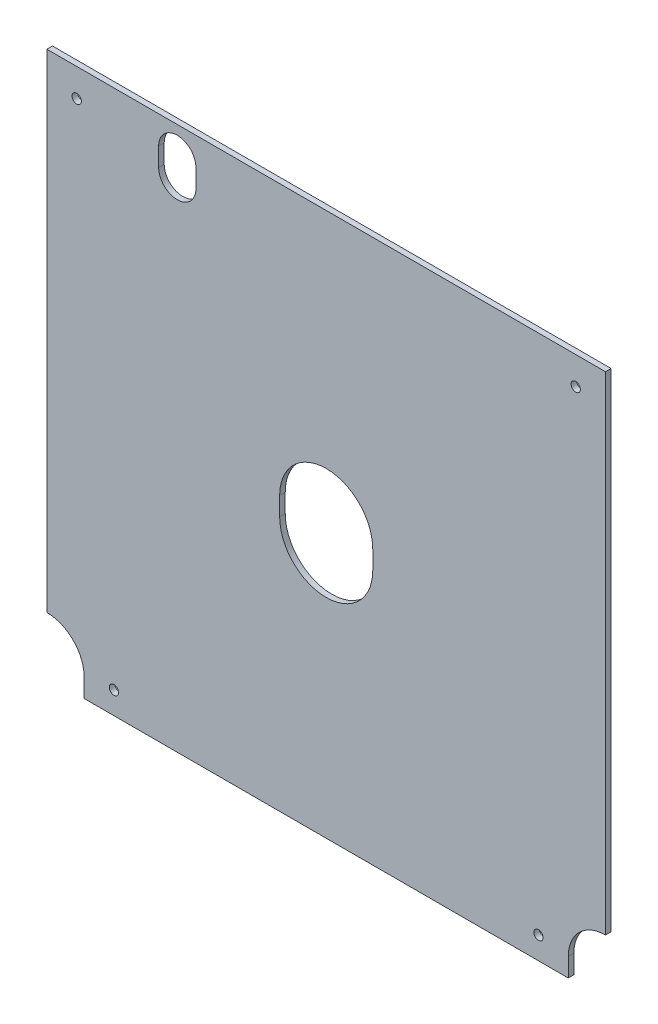
ISO-10303-21;
HEADER;
FILE_DESCRIPTION(('STEP AP214'),'2;1');
FILE_NAME('part.step','',(''),(''),'','','');
FILE_SCHEMA(('AUTOMOTIVE_DESIGN { 1 0 10303 214 1 1 1 1 }'));
ENDSEC;
DATA;
#1=APPLICATION_CONTEXT('core data for automotive mechanical design processes');
#2=APPLICATION_PROTOCOL_DEFINITION('international standard','automotive_design',2000,#1);
#3=PRODUCT_CONTEXT('',#1,'mechanical');
#4=PRODUCT('Part','Part','',(#3));
#5=PRODUCT_RELATED_PRODUCT_CATEGORY('part','',(#4));
#6=PRODUCT_DEFINITION_FORMATION('','',#4);
#7=PRODUCT_DEFINITION_CONTEXT('part definition',#1,'design');
#8=PRODUCT_DEFINITION('design','',#6,#7);
#9=PRODUCT_DEFINITION_SHAPE('','',#8);
#10=(LENGTH_UNIT() NAMED_UNIT(*) SI_UNIT(.MILLI.,.METRE.));
#11=(NAMED_UNIT(*) PLANE_ANGLE_UNIT() SI_UNIT($,.RADIAN.));
#12=(NAMED_UNIT(*) SI_UNIT($,.STERADIAN.) SOLID_ANGLE_UNIT());
#13=UNCERTAINTY_MEASURE_WITH_UNIT(LENGTH_MEASURE(1.E-05),#10,'distance_accuracy_value','');
#14=(GEOMETRIC_REPRESENTATION_CONTEXT(3) GLOBAL_UNCERTAINTY_ASSIGNED_CONTEXT((#13)) GLOBAL_UNIT_ASSIGNED_CONTEXT((#10,
#11,#12)) REPRESENTATION_CONTEXT('',''));
#15=CARTESIAN_POINT('',(0.,0.,0.));
#16=DIRECTION('',(0.,0.,1.));
#17=DIRECTION('',(1.,0.,0.));
#18=AXIS2_PLACEMENT_3D('',#15,#16,#17);
#19=CARTESIAN_POINT('',(-150.,9.99999999999999,3.));
#20=DIRECTION('',(0.,0.,-1.));
#21=DIRECTION('',(-1.,0.,0.));
#22=AXIS2_PLACEMENT_3D('',#19,#20,#21);
#23=PLANE('',#22);
#24=CARTESIAN_POINT('',(114.,12.,3.));
#25=DIRECTION('',(0.,0.,1.));
#26=DIRECTION('',(1.,0.,0.));
#27=AXIS2_PLACEMENT_3D('',#24,#25,#26);
#28=CIRCLE('',#27,2.50000000000001);
#29=CARTESIAN_POINT('',(116.5,12.,3.));
#30=VERTEX_POINT('',#29);
#31=EDGE_CURVE('E400',#30,#30,#28,.T.);
#32=ORIENTED_EDGE('',*,*,#31,.F.);
#33=EDGE_LOOP('',(#32));
#34=FACE_BOUND('',#33,.T.);
#35=CARTESIAN_POINT('',(134.,277.,3.));
#36=DIRECTION('',(0.,0.,1.));
#37=DIRECTION('',(1.,0.,0.));
#38=AXIS2_PLACEMENT_3D('',#35,#36,#37);
#39=CIRCLE('',#38,2.5);
#40=CARTESIAN_POINT('',(136.5,277.,3.));
#41=VERTEX_POINT('',#40);
#42=EDGE_CURVE('E173',#41,#41,#39,.T.);
#43=ORIENTED_EDGE('',*,*,#42,.F.);
#44=EDGE_LOOP('',(#43));
#45=FACE_BOUND('',#44,.T.);
#46=CARTESIAN_POINT('',(0.,137.,3.));
#47=DIRECTION('',(0.,0.,1.));
#48=DIRECTION('',(1.,0.,0.));
#49=AXIS2_PLACEMENT_3D('',#46,#47,#48);
#50=CIRCLE('',#49,25.);
#51=CARTESIAN_POINT('',(-25.,137.,3.));
#52=VERTEX_POINT('',#51);
#53=CARTESIAN_POINT('',(25.,137.,3.));
#54=VERTEX_POINT('',#53);
#55=EDGE_CURVE('E183',#52,#54,#50,.T.);
#56=ORIENTED_EDGE('',*,*,#55,.F.);
#57=DIRECTION('',(0.,-1.,0.));
#58=VECTOR('',#57,1.);
#59=CARTESIAN_POINT('',(-25.,137.,3.));
#60=LINE('',#59,#58);
#61=CARTESIAN_POINT('',(-25.,147.,3.));
#62=VERTEX_POINT('',#61);
#63=EDGE_CURVE('E191',#62,#52,#60,.T.);
#64=ORIENTED_EDGE('',*,*,#63,.F.);
#65=CARTESIAN_POINT('',(0.,147.,3.));
#66=DIRECTION('',(0.,0.,1.));
#67=DIRECTION('',(-1.,0.,0.));
#68=AXIS2_PLACEMENT_3D('',#65,#66,#67);
#69=CIRCLE('',#68,25.);
#70=CARTESIAN_POINT('',(25.,147.,3.));
#71=VERTEX_POINT('',#70);
#72=EDGE_CURVE('E188',#71,#62,#69,.T.);
#73=ORIENTED_EDGE('',*,*,#72,.F.);
#74=DIRECTION('',(0.,1.,0.));
#75=VECTOR('',#74,1.);
#76=CARTESIAN_POINT('',(25.,147.,3.));
#77=LINE('',#76,#75);
#78=EDGE_CURVE('E185',#54,#71,#77,.T.);
#79=ORIENTED_EDGE('',*,*,#78,.F.);
#80=EDGE_LOOP('',(#56,#64,#73,#79));
#81=FACE_BOUND('',#80,.T.);
#82=DIRECTION('',(0.,-1.,0.));
#83=VECTOR('',#82,1.);
#84=CARTESIAN_POINT('',(-150.,292.,3.));
#85=LINE('',#84,#83);
#86=CARTESIAN_POINT('',(-150.,292.,3.));
#87=VERTEX_POINT('',#86);
#88=CARTESIAN_POINT('',(-150.,30.,3.));
#89=VERTEX_POINT('',#88);
#90=EDGE_CURVE('E214',#87,#89,#85,.T.);
#91=ORIENTED_EDGE('',*,*,#90,.T.);
#92=CARTESIAN_POINT('',(-150.,9.99999999999999,3.));
#93=DIRECTION('',(0.,0.,-1.));
#94=DIRECTION('',(-1.,0.,0.));
#95=AXIS2_PLACEMENT_3D('',#92,#93,#94);
#96=CIRCLE('',#95,20.);
#97=CARTESIAN_POINT('',(-130.,9.99999999999999,3.));
#98=VERTEX_POINT('',#97);
#99=EDGE_CURVE('E217',#89,#98,#96,.T.);
#100=ORIENTED_EDGE('',*,*,#99,.T.);
#101=DIRECTION('',(0.,-1.,0.));
#102=VECTOR('',#101,1.);
#103=CARTESIAN_POINT('',(-130.,0.,3.));
#104=LINE('',#103,#102);
#105=CARTESIAN_POINT('',(-130.,0.,3.));
#106=VERTEX_POINT('',#105);
#107=EDGE_CURVE('E220',#98,#106,#104,.T.);
#108=ORIENTED_EDGE('',*,*,#107,.T.);
#109=DIRECTION('',(1.,0.,0.));
#110=VECTOR('',#109,1.);
#111=CARTESIAN_POINT('',(130.,0.,3.));
#112=LINE('',#111,#110);
#113=CARTESIAN_POINT('',(130.,0.,3.));
#114=VERTEX_POINT('',#113);
#115=EDGE_CURVE('E222',#106,#114,#112,.T.);
#116=ORIENTED_EDGE('',*,*,#115,.T.);
#117=DIRECTION('',(0.,1.,0.));
#118=VECTOR('',#117,1.);
#119=CARTESIAN_POINT('',(130.,0.,3.));
#120=LINE('',#119,#118);
#121=CARTESIAN_POINT('',(130.,9.99999999999999,3.));
#122=VERTEX_POINT('',#121);
#123=EDGE_CURVE('E224',#114,#122,#120,.T.);
#124=ORIENTED_EDGE('',*,*,#123,.T.);
#125=CARTESIAN_POINT('',(150.,9.99999999999998,3.));
#126=DIRECTION('',(0.,0.,-1.));
#127=DIRECTION('',(1.,0.,0.));
#128=AXIS2_PLACEMENT_3D('',#125,#126,#127);
#129=CIRCLE('',#128,20.);
#130=CARTESIAN_POINT('',(150.,30.,3.));
#131=VERTEX_POINT('',#130);
#132=EDGE_CURVE('E226',#122,#131,#129,.T.);
#133=ORIENTED_EDGE('',*,*,#132,.T.);
#134=DIRECTION('',(0.,1.,0.));
#135=VECTOR('',#134,1.);
#136=CARTESIAN_POINT('',(150.,292.,3.));
#137=LINE('',#136,#135);
#138=CARTESIAN_POINT('',(150.,292.,3.));
#139=VERTEX_POINT('',#138);
#140=EDGE_CURVE('E228',#131,#139,#137,.T.);
#141=ORIENTED_EDGE('',*,*,#140,.T.);
#142=DIRECTION('',(-1.,0.,0.));
#143=VECTOR('',#142,1.);
#144=CARTESIAN_POINT('',(150.,292.,3.));
#145=LINE('',#144,#143);
#146=EDGE_CURVE('E230',#139,#87,#145,.T.);
#147=ORIENTED_EDGE('',*,*,#146,.T.);
#148=EDGE_LOOP('',(#91,#100,#108,#116,#124,#133,#141,#147));
#149=FACE_BOUND('',#148,.T.);
#150=CARTESIAN_POINT('',(-80.,267.,3.));
#151=DIRECTION('',(0.,0.,1.));
#152=DIRECTION('',(1.,0.,0.));
#153=AXIS2_PLACEMENT_3D('',#150,#151,#152);
#154=CIRCLE('',#153,10.);
#155=CARTESIAN_POINT('',(-90.,267.,3.));
#156=VERTEX_POINT('',#155);
#157=CARTESIAN_POINT('',(-70.,267.,3.));
#158=VERTEX_POINT('',#157);
#159=EDGE_CURVE('E144',#156,#158,#154,.T.);
#160=ORIENTED_EDGE('',*,*,#159,.F.);
#161=DIRECTION('',(0.,-1.,0.));
#162=VECTOR('',#161,1.);
#163=CARTESIAN_POINT('',(-90.,267.,3.));
#164=LINE('',#163,#162);
#165=CARTESIAN_POINT('',(-90.,277.,3.));
#166=VERTEX_POINT('',#165);
#167=EDGE_CURVE('E167',#166,#156,#164,.T.);
#168=ORIENTED_EDGE('',*,*,#167,.F.);
#169=CARTESIAN_POINT('',(-80.,277.,3.));
#170=DIRECTION('',(0.,0.,1.));
#171=DIRECTION('',(-1.,0.,0.));
#172=AXIS2_PLACEMENT_3D('',#169,#170,#171);
#173=CIRCLE('',#172,10.);
#174=CARTESIAN_POINT('',(-70.,277.,3.));
#175=VERTEX_POINT('',#174);
#176=EDGE_CURVE('E165',#175,#166,#173,.T.);
#177=ORIENTED_EDGE('',*,*,#176,.F.);
#178=DIRECTION('',(0.,1.,0.));
#179=VECTOR('',#178,1.);
#180=CARTESIAN_POINT('',(-70.,277.,3.));
#181=LINE('',#180,#179);
#182=EDGE_CURVE('E152',#158,#175,#181,.T.);
#183=ORIENTED_EDGE('',*,*,#182,.F.);
#184=EDGE_LOOP('',(#160,#168,#177,#183));
#185=FACE_BOUND('',#184,.T.);
#186=CARTESIAN_POINT('',(-134.,277.,3.));
#187=DIRECTION('',(0.,0.,1.));
#188=DIRECTION('',(-1.,0.,0.));
#189=AXIS2_PLACEMENT_3D('',#186,#187,#188);
#190=CIRCLE('',#189,2.5);
#191=CARTESIAN_POINT('',(-136.5,277.,3.));
#192=VERTEX_POINT('',#191);
#193=EDGE_CURVE('E406',#192,#192,#190,.T.);
#194=ORIENTED_EDGE('',*,*,#193,.F.);
#195=EDGE_LOOP('',(#194));
#196=FACE_BOUND('',#195,.T.);
#197=CARTESIAN_POINT('',(-114.,12.,3.));
#198=DIRECTION('',(0.,0.,1.));
#199=DIRECTION('',(-1.,0.,0.));
#200=AXIS2_PLACEMENT_3D('',#197,#198,#199);
#201=CIRCLE('',#200,2.50000000000001);
#202=CARTESIAN_POINT('',(-116.5,12.,3.));
#203=VERTEX_POINT('',#202);
#204=EDGE_CURVE('E391',#203,#203,#201,.T.);
#205=ORIENTED_EDGE('',*,*,#204,.F.);
#206=EDGE_LOOP('',(#205));
#207=FACE_BOUND('',#206,.T.);
#208=ADVANCED_FACE('F31',(#34,#45,#81,#149,#185,#196,#207),#23,.F.);
#209=CARTESIAN_POINT('',(-150.,9.99999999999999,0.));
#210=DIRECTION('',(0.,0.,-1.));
#211=DIRECTION('',(-1.,0.,0.));
#212=AXIS2_PLACEMENT_3D('',#209,#210,#211);
#213=PLANE('',#212);
#214=CARTESIAN_POINT('',(114.,12.,0.));
#215=DIRECTION('',(0.,0.,1.));
#216=DIRECTION('',(1.,0.,0.));
#217=AXIS2_PLACEMENT_3D('',#214,#215,#216);
#218=CIRCLE('',#217,2.50000000000001);
#219=CARTESIAN_POINT('',(116.5,12.,0.));
#220=VERTEX_POINT('',#219);
#221=EDGE_CURVE('E397',#220,#220,#218,.T.);
#222=ORIENTED_EDGE('',*,*,#221,.T.);
#223=EDGE_LOOP('',(#222));
#224=FACE_BOUND('',#223,.T.);
#225=CARTESIAN_POINT('',(134.,277.,0.));
#226=DIRECTION('',(0.,0.,1.));
#227=DIRECTION('',(1.,0.,0.));
#228=AXIS2_PLACEMENT_3D('',#225,#226,#227);
#229=CIRCLE('',#228,2.5);
#230=CARTESIAN_POINT('',(136.5,277.,0.));
#231=VERTEX_POINT('',#230);
#232=EDGE_CURVE('E409',#231,#231,#229,.T.);
#233=ORIENTED_EDGE('',*,*,#232,.T.);
#234=EDGE_LOOP('',(#233));
#235=FACE_BOUND('',#234,.T.);
#236=DIRECTION('',(0.,-1.,0.));
#237=VECTOR('',#236,1.);
#238=CARTESIAN_POINT('',(-25.,137.,0.));
#239=LINE('',#238,#237);
#240=CARTESIAN_POINT('',(-25.,147.,0.));
#241=VERTEX_POINT('',#240);
#242=CARTESIAN_POINT('',(-25.,137.,0.));
#243=VERTEX_POINT('',#242);
#244=EDGE_CURVE('E186',#241,#243,#239,.T.);
#245=ORIENTED_EDGE('',*,*,#244,.T.);
#246=CARTESIAN_POINT('',(0.,137.,0.));
#247=DIRECTION('',(0.,0.,1.));
#248=DIRECTION('',(1.,0.,0.));
#249=AXIS2_PLACEMENT_3D('',#246,#247,#248);
#250=CIRCLE('',#249,25.);
#251=CARTESIAN_POINT('',(25.,137.,0.));
#252=VERTEX_POINT('',#251);
#253=EDGE_CURVE('E160',#243,#252,#250,.T.);
#254=ORIENTED_EDGE('',*,*,#253,.T.);
#255=DIRECTION('',(0.,1.,0.));
#256=VECTOR('',#255,1.);
#257=CARTESIAN_POINT('',(25.,147.,0.));
#258=LINE('',#257,#256);
#259=CARTESIAN_POINT('',(25.,147.,0.));
#260=VERTEX_POINT('',#259);
#261=EDGE_CURVE('E196',#252,#260,#258,.T.);
#262=ORIENTED_EDGE('',*,*,#261,.T.);
#263=CARTESIAN_POINT('',(0.,147.,0.));
#264=DIRECTION('',(0.,0.,1.));
#265=DIRECTION('',(-1.,0.,0.));
#266=AXIS2_PLACEMENT_3D('',#263,#264,#265);
#267=CIRCLE('',#266,25.);
#268=EDGE_CURVE('E199',#260,#241,#267,.T.);
#269=ORIENTED_EDGE('',*,*,#268,.T.);
#270=EDGE_LOOP('',(#245,#254,#262,#269));
#271=FACE_BOUND('',#270,.T.);
#272=DIRECTION('',(0.,-1.,0.));
#273=VECTOR('',#272,1.);
#274=CARTESIAN_POINT('',(-150.,292.,0.));
#275=LINE('',#274,#273);
#276=CARTESIAN_POINT('',(-150.,292.,0.));
#277=VERTEX_POINT('',#276);
#278=CARTESIAN_POINT('',(-150.,30.,0.));
#279=VERTEX_POINT('',#278);
#280=EDGE_CURVE('E213',#277,#279,#275,.T.);
#281=ORIENTED_EDGE('',*,*,#280,.F.);
#282=DIRECTION('',(-1.,0.,0.));
#283=VECTOR('',#282,1.);
#284=CARTESIAN_POINT('',(150.,292.,0.));
#285=LINE('',#284,#283);
#286=CARTESIAN_POINT('',(150.,292.,0.));
#287=VERTEX_POINT('',#286);
#288=EDGE_CURVE('E218',#287,#277,#285,.T.);
#289=ORIENTED_EDGE('',*,*,#288,.F.);
#290=DIRECTION('',(0.,1.,0.));
#291=VECTOR('',#290,1.);
#292=CARTESIAN_POINT('',(150.,292.,0.));
#293=LINE('',#292,#291);
#294=CARTESIAN_POINT('',(150.,30.,0.));
#295=VERTEX_POINT('',#294);
#296=EDGE_CURVE('E245',#295,#287,#293,.T.);
#297=ORIENTED_EDGE('',*,*,#296,.F.);
#298=CARTESIAN_POINT('',(150.,9.99999999999998,0.));
#299=DIRECTION('',(0.,0.,-1.));
#300=DIRECTION('',(1.,0.,0.));
#301=AXIS2_PLACEMENT_3D('',#298,#299,#300);
#302=CIRCLE('',#301,20.);
#303=CARTESIAN_POINT('',(130.,9.99999999999999,0.));
#304=VERTEX_POINT('',#303);
#305=EDGE_CURVE('E243',#304,#295,#302,.T.);
#306=ORIENTED_EDGE('',*,*,#305,.F.);
#307=DIRECTION('',(0.,1.,0.));
#308=VECTOR('',#307,1.);
#309=CARTESIAN_POINT('',(130.,0.,0.));
#310=LINE('',#309,#308);
#311=CARTESIAN_POINT('',(130.,0.,0.));
#312=VERTEX_POINT('',#311);
#313=EDGE_CURVE('E241',#312,#304,#310,.T.);
#314=ORIENTED_EDGE('',*,*,#313,.F.);
#315=DIRECTION('',(1.,0.,0.));
#316=VECTOR('',#315,1.);
#317=CARTESIAN_POINT('',(130.,0.,0.));
#318=LINE('',#317,#316);
#319=CARTESIAN_POINT('',(-130.,0.,0.));
#320=VERTEX_POINT('',#319);
#321=EDGE_CURVE('E239',#320,#312,#318,.T.);
#322=ORIENTED_EDGE('',*,*,#321,.F.);
#323=DIRECTION('',(0.,-1.,0.));
#324=VECTOR('',#323,1.);
#325=CARTESIAN_POINT('',(-130.,0.,0.));
#326=LINE('',#325,#324);
#327=CARTESIAN_POINT('',(-130.,9.99999999999999,0.));
#328=VERTEX_POINT('',#327);
#329=EDGE_CURVE('E237',#328,#320,#326,.T.);
#330=ORIENTED_EDGE('',*,*,#329,.F.);
#331=CARTESIAN_POINT('',(-150.,9.99999999999999,0.));
#332=DIRECTION('',(0.,0.,-1.));
#333=DIRECTION('',(-1.,0.,0.));
#334=AXIS2_PLACEMENT_3D('',#331,#332,#333);
#335=CIRCLE('',#334,20.);
#336=EDGE_CURVE('E235',#279,#328,#335,.T.);
#337=ORIENTED_EDGE('',*,*,#336,.F.);
#338=EDGE_LOOP('',(#281,#289,#297,#306,#314,#322,#330,#337));
#339=FACE_BOUND('',#338,.T.);
#340=DIRECTION('',(0.,-1.,0.));
#341=VECTOR('',#340,1.);
#342=CARTESIAN_POINT('',(-90.,267.,0.));
#343=LINE('',#342,#341);
#344=CARTESIAN_POINT('',(-90.,277.,0.));
#345=VERTEX_POINT('',#344);
#346=CARTESIAN_POINT('',(-90.,267.,0.));
#347=VERTEX_POINT('',#346);
#348=EDGE_CURVE('E153',#345,#347,#343,.T.);
#349=ORIENTED_EDGE('',*,*,#348,.T.);
#350=CARTESIAN_POINT('',(-80.,267.,0.));
#351=DIRECTION('',(0.,0.,1.));
#352=DIRECTION('',(1.,0.,0.));
#353=AXIS2_PLACEMENT_3D('',#350,#351,#352);
#354=CIRCLE('',#353,10.);
#355=CARTESIAN_POINT('',(-70.,267.,0.));
#356=VERTEX_POINT('',#355);
#357=EDGE_CURVE('E54',#347,#356,#354,.T.);
#358=ORIENTED_EDGE('',*,*,#357,.T.);
#359=DIRECTION('',(0.,1.,0.));
#360=VECTOR('',#359,1.);
#361=CARTESIAN_POINT('',(-70.,277.,0.));
#362=LINE('',#361,#360);
#363=CARTESIAN_POINT('',(-70.,277.,0.));
#364=VERTEX_POINT('',#363);
#365=EDGE_CURVE('E159',#356,#364,#362,.T.);
#366=ORIENTED_EDGE('',*,*,#365,.T.);
#367=CARTESIAN_POINT('',(-80.,277.,0.));
#368=DIRECTION('',(0.,0.,1.));
#369=DIRECTION('',(-1.,0.,0.));
#370=AXIS2_PLACEMENT_3D('',#367,#368,#369);
#371=CIRCLE('',#370,10.);
#372=EDGE_CURVE('E175',#364,#345,#371,.T.);
#373=ORIENTED_EDGE('',*,*,#372,.T.);
#374=EDGE_LOOP('',(#349,#358,#366,#373));
#375=FACE_BOUND('',#374,.T.);
#376=CARTESIAN_POINT('',(-134.,277.,0.));
#377=DIRECTION('',(0.,0.,1.));
#378=DIRECTION('',(-1.,0.,0.));
#379=AXIS2_PLACEMENT_3D('',#376,#377,#378);
#380=CIRCLE('',#379,2.5);
#381=CARTESIAN_POINT('',(-136.5,277.,0.));
#382=VERTEX_POINT('',#381);
#383=EDGE_CURVE('E403',#382,#382,#380,.T.);
#384=ORIENTED_EDGE('',*,*,#383,.T.);
#385=EDGE_LOOP('',(#384));
#386=FACE_BOUND('',#385,.T.);
#387=CARTESIAN_POINT('',(-114.,12.,0.));
#388=DIRECTION('',(0.,0.,1.));
#389=DIRECTION('',(-1.,0.,0.));
#390=AXIS2_PLACEMENT_3D('',#387,#388,#389);
#391=CIRCLE('',#390,2.50000000000001);
#392=CARTESIAN_POINT('',(-116.5,12.,0.));
#393=VERTEX_POINT('',#392);
#394=EDGE_CURVE('E394',#393,#393,#391,.T.);
#395=ORIENTED_EDGE('',*,*,#394,.T.);
#396=EDGE_LOOP('',(#395));
#397=FACE_BOUND('',#396,.T.);
#398=ADVANCED_FACE('F275',(#224,#235,#271,#339,#375,#386,#397),#213,.T.);
#399=CARTESIAN_POINT('',(-150.,292.,3.));
#400=DIRECTION('',(1.,0.,0.));
#401=DIRECTION('',(0.,1.,0.));
#402=AXIS2_PLACEMENT_3D('',#399,#400,#401);
#403=PLANE('',#402);
#404=ORIENTED_EDGE('',*,*,#280,.T.);
#405=DIRECTION('',(0.,0.,-1.));
#406=VECTOR('',#405,1.);
#407=CARTESIAN_POINT('',(-150.,30.,3.));
#408=LINE('',#407,#406);
#409=EDGE_CURVE('E11',#89,#279,#408,.T.);
#410=ORIENTED_EDGE('',*,*,#409,.F.);
#411=ORIENTED_EDGE('',*,*,#90,.F.);
#412=DIRECTION('',(0.,0.,-1.));
#413=VECTOR('',#412,1.);
#414=CARTESIAN_POINT('',(-150.,292.,3.));
#415=LINE('',#414,#413);
#416=EDGE_CURVE('E232',#87,#277,#415,.T.);
#417=ORIENTED_EDGE('',*,*,#416,.T.);
#418=EDGE_LOOP('',(#404,#410,#411,#417));
#419=FACE_BOUND('',#418,.T.);
#420=ADVANCED_FACE('F33',(#419),#403,.F.);
#421=CARTESIAN_POINT('',(-150.,9.99999999999999,3.));
#422=DIRECTION('',(0.,0.,-1.));
#423=DIRECTION('',(-1.,0.,0.));
#424=AXIS2_PLACEMENT_3D('',#421,#422,#423);
#425=CYLINDRICAL_SURFACE('',#424,20.);
#426=ORIENTED_EDGE('',*,*,#336,.T.);
#427=DIRECTION('',(0.,0.,-1.));
#428=VECTOR('',#427,1.);
#429=CARTESIAN_POINT('',(-130.,9.99999999999999,3.));
#430=LINE('',#429,#428);
#431=EDGE_CURVE('E39',#98,#328,#430,.T.);
#432=ORIENTED_EDGE('',*,*,#431,.F.);
#433=ORIENTED_EDGE('',*,*,#99,.F.);
#434=ORIENTED_EDGE('',*,*,#409,.T.);
#435=EDGE_LOOP('',(#426,#432,#433,#434));
#436=FACE_BOUND('',#435,.T.);
#437=ADVANCED_FACE('F292',(#436),#425,.F.);
#438=CARTESIAN_POINT('',(-130.,0.,3.));
#439=DIRECTION('',(1.,0.,0.));
#440=DIRECTION('',(0.,0.,-1.));
#441=AXIS2_PLACEMENT_3D('',#438,#439,#440);
#442=PLANE('',#441);
#443=ORIENTED_EDGE('',*,*,#329,.T.);
#444=DIRECTION('',(0.,0.,-1.));
#445=VECTOR('',#444,1.);
#446=CARTESIAN_POINT('',(-130.,0.,3.));
#447=LINE('',#446,#445);
#448=EDGE_CURVE('E262',#106,#320,#447,.T.);
#449=ORIENTED_EDGE('',*,*,#448,.F.);
#450=ORIENTED_EDGE('',*,*,#107,.F.);
#451=ORIENTED_EDGE('',*,*,#431,.T.);
#452=EDGE_LOOP('',(#443,#449,#450,#451));
#453=FACE_BOUND('',#452,.T.);
#454=ADVANCED_FACE('F269',(#453),#442,.F.);
#455=CARTESIAN_POINT('',(130.,0.,3.));
#456=DIRECTION('',(0.,1.,0.));
#457=DIRECTION('',(-1.,0.,0.));
#458=AXIS2_PLACEMENT_3D('',#455,#456,#457);
#459=PLANE('',#458);
#460=ORIENTED_EDGE('',*,*,#321,.T.);
#461=DIRECTION('',(0.,0.,-1.));
#462=VECTOR('',#461,1.);
#463=CARTESIAN_POINT('',(130.,0.,3.));
#464=LINE('',#463,#462);
#465=EDGE_CURVE('E259',#114,#312,#464,.T.);
#466=ORIENTED_EDGE('',*,*,#465,.F.);
#467=ORIENTED_EDGE('',*,*,#115,.F.);
#468=ORIENTED_EDGE('',*,*,#448,.T.);
#469=EDGE_LOOP('',(#460,#466,#467,#468));
#470=FACE_BOUND('',#469,.T.);
#471=ADVANCED_FACE('F281',(#470),#459,.F.);
#472=CARTESIAN_POINT('',(130.,0.,3.));
#473=DIRECTION('',(-1.,0.,0.));
#474=DIRECTION('',(0.,0.,1.));
#475=AXIS2_PLACEMENT_3D('',#472,#473,#474);
#476=PLANE('',#475);
#477=ORIENTED_EDGE('',*,*,#313,.T.);
#478=DIRECTION('',(0.,0.,-1.));
#479=VECTOR('',#478,1.);
#480=CARTESIAN_POINT('',(130.,9.99999999999999,3.));
#481=LINE('',#480,#479);
#482=EDGE_CURVE('E256',#122,#304,#481,.T.);
#483=ORIENTED_EDGE('',*,*,#482,.F.);
#484=ORIENTED_EDGE('',*,*,#123,.F.);
#485=ORIENTED_EDGE('',*,*,#465,.T.);
#486=EDGE_LOOP('',(#477,#483,#484,#485));
#487=FACE_BOUND('',#486,.T.);
#488=ADVANCED_FACE('F285',(#487),#476,.F.);
#489=CARTESIAN_POINT('',(150.,9.99999999999998,3.));
#490=DIRECTION('',(0.,0.,-1.));
#491=DIRECTION('',(-1.,0.,0.));
#492=AXIS2_PLACEMENT_3D('',#489,#490,#491);
#493=CYLINDRICAL_SURFACE('',#492,20.);
#494=ORIENTED_EDGE('',*,*,#305,.T.);
#495=DIRECTION('',(0.,0.,-1.));
#496=VECTOR('',#495,1.);
#497=CARTESIAN_POINT('',(150.,30.,3.));
#498=LINE('',#497,#496);
#499=EDGE_CURVE('E253',#131,#295,#498,.T.);
#500=ORIENTED_EDGE('',*,*,#499,.F.);
#501=ORIENTED_EDGE('',*,*,#132,.F.);
#502=ORIENTED_EDGE('',*,*,#482,.T.);
#503=EDGE_LOOP('',(#494,#500,#501,#502));
#504=FACE_BOUND('',#503,.T.);
#505=ADVANCED_FACE('F305',(#504),#493,.F.);
#506=CARTESIAN_POINT('',(150.,292.,3.));
#507=DIRECTION('',(-1.,0.,0.));
#508=DIRECTION('',(0.,-1.,0.));
#509=AXIS2_PLACEMENT_3D('',#506,#507,#508);
#510=PLANE('',#509);
#511=ORIENTED_EDGE('',*,*,#296,.T.);
#512=DIRECTION('',(0.,0.,-1.));
#513=VECTOR('',#512,1.);
#514=CARTESIAN_POINT('',(150.,292.,3.));
#515=LINE('',#514,#513);
#516=EDGE_CURVE('E250',#139,#287,#515,.T.);
#517=ORIENTED_EDGE('',*,*,#516,.F.);
#518=ORIENTED_EDGE('',*,*,#140,.F.);
#519=ORIENTED_EDGE('',*,*,#499,.T.);
#520=EDGE_LOOP('',(#511,#517,#518,#519));
#521=FACE_BOUND('',#520,.T.);
#522=ADVANCED_FACE('F303',(#521),#510,.F.);
#523=CARTESIAN_POINT('',(150.,292.,3.));
#524=DIRECTION('',(0.,-1.,0.));
#525=DIRECTION('',(0.,0.,-1.));
#526=AXIS2_PLACEMENT_3D('',#523,#524,#525);
#527=PLANE('',#526);
#528=ORIENTED_EDGE('',*,*,#288,.T.);
#529=ORIENTED_EDGE('',*,*,#416,.F.);
#530=ORIENTED_EDGE('',*,*,#146,.F.);
#531=ORIENTED_EDGE('',*,*,#516,.T.);
#532=EDGE_LOOP('',(#528,#529,#530,#531));
#533=FACE_BOUND('',#532,.T.);
#534=ADVANCED_FACE('F298',(#533),#527,.F.);
#535=CARTESIAN_POINT('',(0.,137.,3.));
#536=DIRECTION('',(0.,0.,-1.));
#537=DIRECTION('',(-1.,0.,0.));
#538=AXIS2_PLACEMENT_3D('',#535,#536,#537);
#539=CYLINDRICAL_SURFACE('',#538,25.);
#540=ORIENTED_EDGE('',*,*,#253,.F.);
#541=DIRECTION('',(0.,0.,-1.));
#542=VECTOR('',#541,1.);
#543=CARTESIAN_POINT('',(-25.,137.,3.));
#544=LINE('',#543,#542);
#545=EDGE_CURVE('E193',#52,#243,#544,.T.);
#546=ORIENTED_EDGE('',*,*,#545,.F.);
#547=ORIENTED_EDGE('',*,*,#55,.T.);
#548=DIRECTION('',(0.,0.,-1.));
#549=VECTOR('',#548,1.);
#550=CARTESIAN_POINT('',(25.,137.,3.));
#551=LINE('',#550,#549);
#552=EDGE_CURVE('E210',#54,#252,#551,.T.);
#553=ORIENTED_EDGE('',*,*,#552,.T.);
#554=EDGE_LOOP('',(#540,#546,#547,#553));
#555=FACE_BOUND('',#554,.T.);
#556=ADVANCED_FACE('F325',(#555),#539,.F.);
#557=CARTESIAN_POINT('',(25.,147.,3.));
#558=DIRECTION('',(-1.,0.,0.));
#559=DIRECTION('',(0.,0.,1.));
#560=AXIS2_PLACEMENT_3D('',#557,#558,#559);
#561=PLANE('',#560);
#562=ORIENTED_EDGE('',*,*,#261,.F.);
#563=ORIENTED_EDGE('',*,*,#552,.F.);
#564=ORIENTED_EDGE('',*,*,#78,.T.);
#565=DIRECTION('',(0.,0.,-1.));
#566=VECTOR('',#565,1.);
#567=CARTESIAN_POINT('',(25.,147.,3.));
#568=LINE('',#567,#566);
#569=EDGE_CURVE('E208',#71,#260,#568,.T.);
#570=ORIENTED_EDGE('',*,*,#569,.T.);
#571=EDGE_LOOP('',(#562,#563,#564,#570));
#572=FACE_BOUND('',#571,.T.);
#573=ADVANCED_FACE('F332',(#572),#561,.T.);
#574=CARTESIAN_POINT('',(0.,147.,3.));
#575=DIRECTION('',(0.,0.,-1.));
#576=DIRECTION('',(-1.,0.,0.));
#577=AXIS2_PLACEMENT_3D('',#574,#575,#576);
#578=CYLINDRICAL_SURFACE('',#577,25.);
#579=ORIENTED_EDGE('',*,*,#268,.F.);
#580=ORIENTED_EDGE('',*,*,#569,.F.);
#581=ORIENTED_EDGE('',*,*,#72,.T.);
#582=DIRECTION('',(0.,0.,-1.));
#583=VECTOR('',#582,1.);
#584=CARTESIAN_POINT('',(-25.,147.,3.));
#585=LINE('',#584,#583);
#586=EDGE_CURVE('E206',#62,#241,#585,.T.);
#587=ORIENTED_EDGE('',*,*,#586,.T.);
#588=EDGE_LOOP('',(#579,#580,#581,#587));
#589=FACE_BOUND('',#588,.T.);
#590=ADVANCED_FACE('F337',(#589),#578,.F.);
#591=CARTESIAN_POINT('',(-25.,137.,3.));
#592=DIRECTION('',(1.,0.,0.));
#593=DIRECTION('',(0.,1.,0.));
#594=AXIS2_PLACEMENT_3D('',#591,#592,#593);
#595=PLANE('',#594);
#596=ORIENTED_EDGE('',*,*,#244,.F.);
#597=ORIENTED_EDGE('',*,*,#586,.F.);
#598=ORIENTED_EDGE('',*,*,#63,.T.);
#599=ORIENTED_EDGE('',*,*,#545,.T.);
#600=EDGE_LOOP('',(#596,#597,#598,#599));
#601=FACE_BOUND('',#600,.T.);
#602=ADVANCED_FACE('F345',(#601),#595,.T.);
#603=CARTESIAN_POINT('',(-80.,267.,3.));
#604=DIRECTION('',(0.,0.,-1.));
#605=DIRECTION('',(-1.,0.,0.));
#606=AXIS2_PLACEMENT_3D('',#603,#604,#605);
#607=CYLINDRICAL_SURFACE('',#606,10.);
#608=ORIENTED_EDGE('',*,*,#357,.F.);
#609=DIRECTION('',(0.,0.,-1.));
#610=VECTOR('',#609,1.);
#611=CARTESIAN_POINT('',(-90.,267.,3.));
#612=LINE('',#611,#610);
#613=EDGE_CURVE('E148',#156,#347,#612,.T.);
#614=ORIENTED_EDGE('',*,*,#613,.F.);
#615=ORIENTED_EDGE('',*,*,#159,.T.);
#616=DIRECTION('',(0.,0.,-1.));
#617=VECTOR('',#616,1.);
#618=CARTESIAN_POINT('',(-70.,267.,3.));
#619=LINE('',#618,#617);
#620=EDGE_CURVE('E147',#158,#356,#619,.T.);
#621=ORIENTED_EDGE('',*,*,#620,.T.);
#622=EDGE_LOOP('',(#608,#614,#615,#621));
#623=FACE_BOUND('',#622,.T.);
#624=ADVANCED_FACE('F146',(#623),#607,.F.);
#625=CARTESIAN_POINT('',(-70.,277.,3.));
#626=DIRECTION('',(-1.,0.,0.));
#627=DIRECTION('',(0.,0.,1.));
#628=AXIS2_PLACEMENT_3D('',#625,#626,#627);
#629=PLANE('',#628);
#630=ORIENTED_EDGE('',*,*,#365,.F.);
#631=ORIENTED_EDGE('',*,*,#620,.F.);
#632=ORIENTED_EDGE('',*,*,#182,.T.);
#633=DIRECTION('',(0.,0.,-1.));
#634=VECTOR('',#633,1.);
#635=CARTESIAN_POINT('',(-70.,277.,3.));
#636=LINE('',#635,#634);
#637=EDGE_CURVE('E161',#175,#364,#636,.T.);
#638=ORIENTED_EDGE('',*,*,#637,.T.);
#639=EDGE_LOOP('',(#630,#631,#632,#638));
#640=FACE_BOUND('',#639,.T.);
#641=ADVANCED_FACE('F156',(#640),#629,.T.);
#642=CARTESIAN_POINT('',(-80.,277.,3.));
#643=DIRECTION('',(0.,0.,-1.));
#644=DIRECTION('',(-1.,0.,0.));
#645=AXIS2_PLACEMENT_3D('',#642,#643,#644);
#646=CYLINDRICAL_SURFACE('',#645,10.);
#647=ORIENTED_EDGE('',*,*,#372,.F.);
#648=ORIENTED_EDGE('',*,*,#637,.F.);
#649=ORIENTED_EDGE('',*,*,#176,.T.);
#650=DIRECTION('',(0.,0.,-1.));
#651=VECTOR('',#650,1.);
#652=CARTESIAN_POINT('',(-90.,277.,3.));
#653=LINE('',#652,#651);
#654=EDGE_CURVE('E46',#166,#345,#653,.T.);
#655=ORIENTED_EDGE('',*,*,#654,.T.);
#656=EDGE_LOOP('',(#647,#648,#649,#655));
#657=FACE_BOUND('',#656,.T.);
#658=ADVANCED_FACE('F364',(#657),#646,.F.);
#659=CARTESIAN_POINT('',(-90.,267.,3.));
#660=DIRECTION('',(1.,0.,0.));
#661=DIRECTION('',(0.,0.,-1.));
#662=AXIS2_PLACEMENT_3D('',#659,#660,#661);
#663=PLANE('',#662);
#664=ORIENTED_EDGE('',*,*,#348,.F.);
#665=ORIENTED_EDGE('',*,*,#654,.F.);
#666=ORIENTED_EDGE('',*,*,#167,.T.);
#667=ORIENTED_EDGE('',*,*,#613,.T.);
#668=EDGE_LOOP('',(#664,#665,#666,#667));
#669=FACE_BOUND('',#668,.T.);
#670=ADVANCED_FACE('F367',(#669),#663,.T.);
#671=CARTESIAN_POINT('',(134.,277.,3.));
#672=DIRECTION('',(0.,0.,-1.));
#673=DIRECTION('',(-1.,0.,0.));
#674=AXIS2_PLACEMENT_3D('',#671,#672,#673);
#675=CYLINDRICAL_SURFACE('',#674,2.5);
#676=ORIENTED_EDGE('',*,*,#42,.T.);
#677=EDGE_LOOP('',(#676));
#678=FACE_BOUND('',#677,.T.);
#679=ORIENTED_EDGE('',*,*,#232,.F.);
#680=EDGE_LOOP('',(#679));
#681=FACE_BOUND('',#680,.T.);
#682=ADVANCED_FACE('F371',(#678,#681),#675,.F.);
#683=CARTESIAN_POINT('',(-134.,277.,3.));
#684=DIRECTION('',(0.,0.,-1.));
#685=DIRECTION('',(-1.,0.,0.));
#686=AXIS2_PLACEMENT_3D('',#683,#684,#685);
#687=CYLINDRICAL_SURFACE('',#686,2.5);
#688=ORIENTED_EDGE('',*,*,#193,.T.);
#689=EDGE_LOOP('',(#688));
#690=FACE_BOUND('',#689,.T.);
#691=ORIENTED_EDGE('',*,*,#383,.F.);
#692=EDGE_LOOP('',(#691));
#693=FACE_BOUND('',#692,.T.);
#694=ADVANCED_FACE('F374',(#690,#693),#687,.F.);
#695=CARTESIAN_POINT('',(114.,12.,3.));
#696=DIRECTION('',(0.,0.,-1.));
#697=DIRECTION('',(-1.,0.,0.));
#698=AXIS2_PLACEMENT_3D('',#695,#696,#697);
#699=CYLINDRICAL_SURFACE('',#698,2.50000000000001);
#700=ORIENTED_EDGE('',*,*,#31,.T.);
#701=EDGE_LOOP('',(#700));
#702=FACE_BOUND('',#701,.T.);
#703=ORIENTED_EDGE('',*,*,#221,.F.);
#704=EDGE_LOOP('',(#703));
#705=FACE_BOUND('',#704,.T.);
#706=ADVANCED_FACE('F378',(#702,#705),#699,.F.);
#707=CARTESIAN_POINT('',(-114.,12.,3.));
#708=DIRECTION('',(0.,0.,-1.));
#709=DIRECTION('',(-1.,0.,0.));
#710=AXIS2_PLACEMENT_3D('',#707,#708,#709);
#711=CYLINDRICAL_SURFACE('',#710,2.50000000000001);
#712=ORIENTED_EDGE('',*,*,#204,.T.);
#713=EDGE_LOOP('',(#712));
#714=FACE_BOUND('',#713,.T.);
#715=ORIENTED_EDGE('',*,*,#394,.F.);
#716=EDGE_LOOP('',(#715));
#717=FACE_BOUND('',#716,.T.);
#718=ADVANCED_FACE('F382',(#714,#717),#711,.F.);
#719=CLOSED_SHELL('',(#208,#398,#420,#437,#454,#471,#488,#505,#522,#534,#556,#573,#590,#602,
#624,#641,#658,#670,#682,#694,#706,#718));
#720=MANIFOLD_SOLID_BREP('B2',#719);
#721=ADVANCED_BREP_SHAPE_REPRESENTATION('',(#18,#720),#14);
#722=SHAPE_DEFINITION_REPRESENTATION(#9,#721);
ENDSEC;
END-ISO-10303-21;
